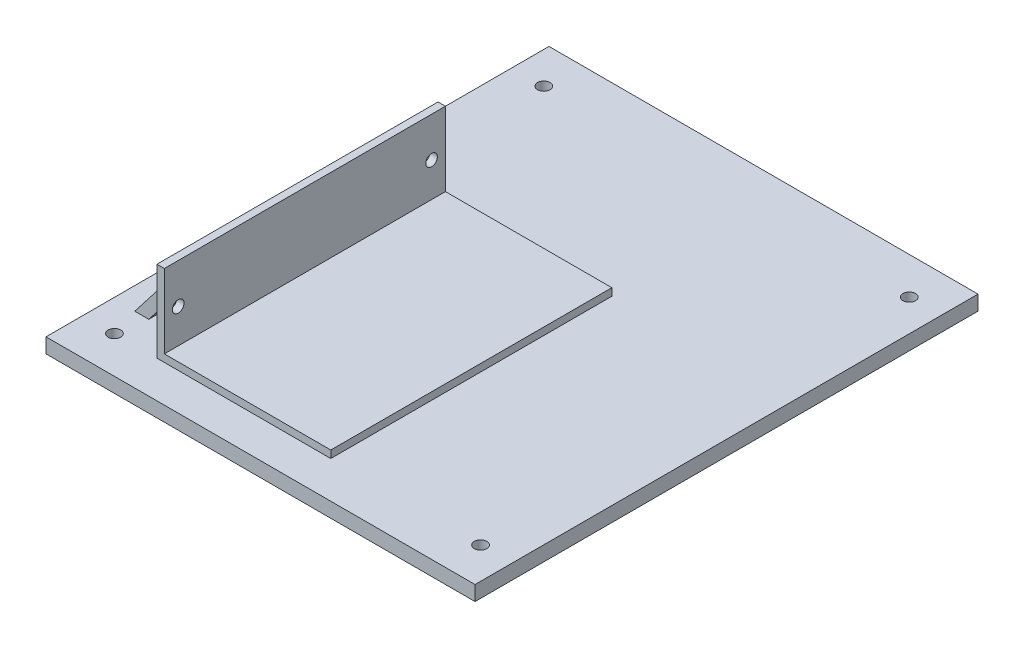
ISO-10303-21;
HEADER;
FILE_DESCRIPTION(('STEP AP214'),'2;1');
FILE_NAME('part.step','',(''),(''),'','','');
FILE_SCHEMA(('AUTOMOTIVE_DESIGN { 1 0 10303 214 1 1 1 1 }'));
ENDSEC;
DATA;
#1=APPLICATION_CONTEXT('core data for automotive mechanical design processes');
#2=APPLICATION_PROTOCOL_DEFINITION('international standard','automotive_design',2000,#1);
#3=PRODUCT_CONTEXT('',#1,'mechanical');
#4=PRODUCT('Part','Part','',(#3));
#5=PRODUCT_RELATED_PRODUCT_CATEGORY('part','',(#4));
#6=PRODUCT_DEFINITION_FORMATION('','',#4);
#7=PRODUCT_DEFINITION_CONTEXT('part definition',#1,'design');
#8=PRODUCT_DEFINITION('design','',#6,#7);
#9=PRODUCT_DEFINITION_SHAPE('','',#8);
#10=(LENGTH_UNIT() NAMED_UNIT(*) SI_UNIT(.MILLI.,.METRE.));
#11=(NAMED_UNIT(*) PLANE_ANGLE_UNIT() SI_UNIT($,.RADIAN.));
#12=(NAMED_UNIT(*) SI_UNIT($,.STERADIAN.) SOLID_ANGLE_UNIT());
#13=UNCERTAINTY_MEASURE_WITH_UNIT(LENGTH_MEASURE(1.E-05),#10,'distance_accuracy_value','');
#14=(GEOMETRIC_REPRESENTATION_CONTEXT(3) GLOBAL_UNCERTAINTY_ASSIGNED_CONTEXT((#13)) GLOBAL_UNIT_ASSIGNED_CONTEXT((#10,
#11,#12)) REPRESENTATION_CONTEXT('',''));
#15=CARTESIAN_POINT('',(0.,0.,0.));
#16=DIRECTION('',(0.,0.,1.));
#17=DIRECTION('',(1.,0.,0.));
#18=AXIS2_PLACEMENT_3D('',#15,#16,#17);
#19=CARTESIAN_POINT('',(-73.66,2.54,172.72));
#20=DIRECTION('',(0.,-1.,0.));
#21=DIRECTION('',(0.,0.,-1.));
#22=AXIS2_PLACEMENT_3D('',#19,#20,#21);
#23=PLANE('',#22);
#24=CARTESIAN_POINT('',(-62.738,2.54,12.7));
#25=DIRECTION('',(0.,1.,0.));
#26=DIRECTION('',(0.,0.,1.));
#27=AXIS2_PLACEMENT_3D('',#24,#25,#26);
#28=CIRCLE('',#27,2.159);
#29=CARTESIAN_POINT('',(-62.738,2.54,14.859));
#30=VERTEX_POINT('',#29);
#31=EDGE_CURVE('E232',#30,#30,#28,.T.);
#32=ORIENTED_EDGE('',*,*,#31,.F.);
#33=EDGE_LOOP('',(#32));
#34=FACE_BOUND('',#33,.T.);
#35=DIRECTION('',(-1.,0.,0.));
#36=VECTOR('',#35,1.);
#37=CARTESIAN_POINT('',(-73.66,2.54,0.));
#38=LINE('',#37,#36);
#39=CARTESIAN_POINT('',(73.66,2.54,0.));
#40=VERTEX_POINT('',#39);
#41=CARTESIAN_POINT('',(-73.66,2.54,0.));
#42=VERTEX_POINT('',#41);
#43=EDGE_CURVE('E256',#40,#42,#38,.T.);
#44=ORIENTED_EDGE('',*,*,#43,.T.);
#45=DIRECTION('',(0.,0.,-1.));
#46=VECTOR('',#45,1.);
#47=CARTESIAN_POINT('',(-73.66,2.54,172.72));
#48=LINE('',#47,#46);
#49=CARTESIAN_POINT('',(-73.66,2.54,172.72));
#50=VERTEX_POINT('',#49);
#51=EDGE_CURVE('E50',#50,#42,#48,.T.);
#52=ORIENTED_EDGE('',*,*,#51,.F.);
#53=DIRECTION('',(-1.,0.,0.));
#54=VECTOR('',#53,1.);
#55=CARTESIAN_POINT('',(-73.66,2.54,172.72));
#56=LINE('',#55,#54);
#57=CARTESIAN_POINT('',(73.66,2.54,172.72));
#58=VERTEX_POINT('',#57);
#59=EDGE_CURVE('E246',#58,#50,#56,.T.);
#60=ORIENTED_EDGE('',*,*,#59,.F.);
#61=DIRECTION('',(0.,0.,-1.));
#62=VECTOR('',#61,1.);
#63=CARTESIAN_POINT('',(73.66,2.54,172.72));
#64=LINE('',#63,#62);
#65=EDGE_CURVE('E11',#58,#40,#64,.T.);
#66=ORIENTED_EDGE('',*,*,#65,.T.);
#67=EDGE_LOOP('',(#44,#52,#60,#66));
#68=FACE_BOUND('',#67,.T.);
#69=DIRECTION('',(0.,0.,1.));
#70=VECTOR('',#69,1.);
#71=CARTESIAN_POINT('',(-48.26,2.54,63.5));
#72=LINE('',#71,#70);
#73=CARTESIAN_POINT('',(-48.26,2.54,63.5));
#74=VERTEX_POINT('',#73);
#75=CARTESIAN_POINT('',(-48.26,2.54,160.02));
#76=VERTEX_POINT('',#75);
#77=EDGE_CURVE('E190',#74,#76,#72,.T.);
#78=ORIENTED_EDGE('',*,*,#77,.F.);
#79=DIRECTION('',(-1.,0.,0.));
#80=VECTOR('',#79,1.);
#81=CARTESIAN_POINT('',(-48.26,2.54,63.5));
#82=LINE('',#81,#80);
#83=CARTESIAN_POINT('',(11.43,2.54,63.5));
#84=VERTEX_POINT('',#83);
#85=EDGE_CURVE('E194',#84,#74,#82,.T.);
#86=ORIENTED_EDGE('',*,*,#85,.F.);
#87=DIRECTION('',(0.,0.,-1.));
#88=VECTOR('',#87,1.);
#89=CARTESIAN_POINT('',(11.43,2.54,63.5));
#90=LINE('',#89,#88);
#91=CARTESIAN_POINT('',(11.43,2.54,160.02));
#92=VERTEX_POINT('',#91);
#93=EDGE_CURVE('E203',#92,#84,#90,.T.);
#94=ORIENTED_EDGE('',*,*,#93,.F.);
#95=DIRECTION('',(1.,0.,0.));
#96=VECTOR('',#95,1.);
#97=CARTESIAN_POINT('',(-48.26,2.54,160.02));
#98=LINE('',#97,#96);
#99=EDGE_CURVE('E200',#76,#92,#98,.T.);
#100=ORIENTED_EDGE('',*,*,#99,.F.);
#101=EDGE_LOOP('',(#78,#86,#94,#100));
#102=FACE_BOUND('',#101,.T.);
#103=CARTESIAN_POINT('',(62.865,2.54,160.02));
#104=DIRECTION('',(0.,1.,0.));
#105=DIRECTION('',(0.,0.,1.));
#106=AXIS2_PLACEMENT_3D('',#103,#104,#105);
#107=CIRCLE('',#106,2.15899999999999);
#108=CARTESIAN_POINT('',(62.865,2.54,162.179));
#109=VERTEX_POINT('',#108);
#110=EDGE_CURVE('E226',#109,#109,#107,.T.);
#111=ORIENTED_EDGE('',*,*,#110,.F.);
#112=EDGE_LOOP('',(#111));
#113=FACE_BOUND('',#112,.T.);
#114=CARTESIAN_POINT('',(-62.865,2.54,160.02));
#115=DIRECTION('',(0.,1.,0.));
#116=DIRECTION('',(0.,0.,1.));
#117=AXIS2_PLACEMENT_3D('',#114,#115,#116);
#118=CIRCLE('',#117,2.15899999999999);
#119=CARTESIAN_POINT('',(-62.865,2.54,162.179));
#120=VERTEX_POINT('',#119);
#121=EDGE_CURVE('E219',#120,#120,#118,.T.);
#122=ORIENTED_EDGE('',*,*,#121,.F.);
#123=EDGE_LOOP('',(#122));
#124=FACE_BOUND('',#123,.T.);
#125=CARTESIAN_POINT('',(62.738,2.54,12.7));
#126=DIRECTION('',(0.,1.,0.));
#127=DIRECTION('',(0.,0.,1.));
#128=AXIS2_PLACEMENT_3D('',#125,#126,#127);
#129=CIRCLE('',#128,2.15899999999999);
#130=CARTESIAN_POINT('',(62.738,2.54,14.859));
#131=VERTEX_POINT('',#130);
#132=EDGE_CURVE('E222',#131,#131,#129,.T.);
#133=ORIENTED_EDGE('',*,*,#132,.F.);
#134=EDGE_LOOP('',(#133));
#135=FACE_BOUND('',#134,.T.);
#136=DIRECTION('',(1.,0.,0.));
#137=VECTOR('',#136,1.);
#138=CARTESIAN_POINT('',(-66.04,2.54,73.66));
#139=LINE('',#138,#137);
#140=CARTESIAN_POINT('',(-66.04,2.54,73.66));
#141=VERTEX_POINT('',#140);
#142=CARTESIAN_POINT('',(-61.2132573670803,2.54,73.66));
#143=VERTEX_POINT('',#142);
#144=EDGE_CURVE('E149',#141,#143,#139,.T.);
#145=ORIENTED_EDGE('',*,*,#144,.T.);
#146=DIRECTION('',(0.,0.,1.));
#147=VECTOR('',#146,1.);
#148=CARTESIAN_POINT('',(-61.2132573670803,2.54,0.));
#149=LINE('',#148,#147);
#150=CARTESIAN_POINT('',(-61.2132573670803,2.54,149.86));
#151=VERTEX_POINT('',#150);
#152=EDGE_CURVE('E144',#143,#151,#149,.T.);
#153=ORIENTED_EDGE('',*,*,#152,.T.);
#154=DIRECTION('',(1.,0.,0.));
#155=VECTOR('',#154,1.);
#156=CARTESIAN_POINT('',(-66.04,2.54,149.86));
#157=LINE('',#156,#155);
#158=CARTESIAN_POINT('',(-66.04,2.54,149.86));
#159=VERTEX_POINT('',#158);
#160=EDGE_CURVE('E147',#159,#151,#157,.T.);
#161=ORIENTED_EDGE('',*,*,#160,.F.);
#162=DIRECTION('',(0.,0.,1.));
#163=VECTOR('',#162,1.);
#164=CARTESIAN_POINT('',(-66.04,2.54,73.66));
#165=LINE('',#164,#163);
#166=EDGE_CURVE('E163',#141,#159,#165,.T.);
#167=ORIENTED_EDGE('',*,*,#166,.F.);
#168=EDGE_LOOP('',(#145,#153,#161,#167));
#169=FACE_BOUND('',#168,.T.);
#170=ADVANCED_FACE('F42',(#34,#68,#102,#113,#124,#135,#169),#23,.F.);
#171=CARTESIAN_POINT('',(-48.26,5.08,63.5));
#172=DIRECTION('',(1.,0.,0.));
#173=DIRECTION('',(0.,0.,-1.));
#174=AXIS2_PLACEMENT_3D('',#171,#172,#173);
#175=PLANE('',#174);
#176=CARTESIAN_POINT('',(-48.26,16.83,155.26));
#177=DIRECTION('',(1.,0.,0.));
#178=DIRECTION('',(0.,0.,-1.));
#179=AXIS2_PLACEMENT_3D('',#176,#177,#178);
#180=CIRCLE('',#179,2.);
#181=CARTESIAN_POINT('',(-48.26,16.83,153.26));
#182=VERTEX_POINT('',#181);
#183=EDGE_CURVE('E152',#182,#182,#180,.T.);
#184=ORIENTED_EDGE('',*,*,#183,.T.);
#185=EDGE_LOOP('',(#184));
#186=FACE_BOUND('',#185,.T.);
#187=CARTESIAN_POINT('',(-48.26,16.83,68.26));
#188=DIRECTION('',(1.,0.,0.));
#189=DIRECTION('',(0.,0.,-1.));
#190=AXIS2_PLACEMENT_3D('',#187,#188,#189);
#191=CIRCLE('',#190,2.);
#192=CARTESIAN_POINT('',(-48.26,16.83,66.26));
#193=VERTEX_POINT('',#192);
#194=EDGE_CURVE('E420',#193,#193,#191,.T.);
#195=ORIENTED_EDGE('',*,*,#194,.T.);
#196=EDGE_LOOP('',(#195));
#197=FACE_BOUND('',#196,.T.);
#198=DIRECTION('',(0.,0.,1.));
#199=VECTOR('',#198,1.);
#200=CARTESIAN_POINT('',(-48.26,19.194188043389,0.));
#201=LINE('',#200,#199);
#202=CARTESIAN_POINT('',(-48.26,19.194188043389,73.66));
#203=VERTEX_POINT('',#202);
#204=CARTESIAN_POINT('',(-48.26,19.194188043389,149.86));
#205=VERTEX_POINT('',#204);
#206=EDGE_CURVE('E57',#203,#205,#201,.T.);
#207=ORIENTED_EDGE('',*,*,#206,.F.);
#208=DIRECTION('',(0.,-1.,0.));
#209=VECTOR('',#208,1.);
#210=CARTESIAN_POINT('',(-48.26,2.54,73.66));
#211=LINE('',#210,#209);
#212=CARTESIAN_POINT('',(-48.26,25.4,73.66));
#213=VERTEX_POINT('',#212);
#214=EDGE_CURVE('E430',#213,#203,#211,.T.);
#215=ORIENTED_EDGE('',*,*,#214,.F.);
#216=DIRECTION('',(0.,0.,-1.));
#217=VECTOR('',#216,1.);
#218=CARTESIAN_POINT('',(-48.26,25.4,73.66));
#219=LINE('',#218,#217);
#220=CARTESIAN_POINT('',(-48.26,25.4,149.86));
#221=VERTEX_POINT('',#220);
#222=EDGE_CURVE('E167',#221,#213,#219,.T.);
#223=ORIENTED_EDGE('',*,*,#222,.F.);
#224=DIRECTION('',(0.,1.,0.));
#225=VECTOR('',#224,1.);
#226=CARTESIAN_POINT('',(-48.26,2.54,149.86));
#227=LINE('',#226,#225);
#228=EDGE_CURVE('E433',#205,#221,#227,.T.);
#229=ORIENTED_EDGE('',*,*,#228,.F.);
#230=EDGE_LOOP('',(#207,#215,#223,#229));
#231=FACE_BOUND('',#230,.T.);
#232=DIRECTION('',(0.,-1.,0.));
#233=VECTOR('',#232,1.);
#234=CARTESIAN_POINT('',(-48.26,5.08,63.5));
#235=LINE('',#234,#233);
#236=CARTESIAN_POINT('',(-48.26,30.48,63.5));
#237=VERTEX_POINT('',#236);
#238=EDGE_CURVE('E198',#237,#74,#235,.T.);
#239=ORIENTED_EDGE('',*,*,#238,.T.);
#240=ORIENTED_EDGE('',*,*,#77,.T.);
#241=DIRECTION('',(0.,-1.,0.));
#242=VECTOR('',#241,1.);
#243=CARTESIAN_POINT('',(-48.26,5.08,160.02));
#244=LINE('',#243,#242);
#245=CARTESIAN_POINT('',(-48.26,30.48,160.02));
#246=VERTEX_POINT('',#245);
#247=EDGE_CURVE('E215',#246,#76,#244,.T.);
#248=ORIENTED_EDGE('',*,*,#247,.F.);
#249=DIRECTION('',(0.,0.,1.));
#250=VECTOR('',#249,1.);
#251=CARTESIAN_POINT('',(-48.26,30.48,63.5));
#252=LINE('',#251,#250);
#253=EDGE_CURVE('E172',#237,#246,#252,.T.);
#254=ORIENTED_EDGE('',*,*,#253,.F.);
#255=EDGE_LOOP('',(#239,#240,#248,#254));
#256=FACE_BOUND('',#255,.T.);
#257=ADVANCED_FACE('F288',(#186,#197,#231,#256),#175,.F.);
#258=CARTESIAN_POINT('',(73.66,-2.54,172.72));
#259=DIRECTION('',(-1.,0.,0.));
#260=DIRECTION('',(0.,0.,1.));
#261=AXIS2_PLACEMENT_3D('',#258,#259,#260);
#262=PLANE('',#261);
#263=DIRECTION('',(0.,1.,0.));
#264=VECTOR('',#263,1.);
#265=CARTESIAN_POINT('',(73.66,-2.54,0.));
#266=LINE('',#265,#264);
#267=CARTESIAN_POINT('',(73.66,-2.54,0.));
#268=VERTEX_POINT('',#267);
#269=EDGE_CURVE('E240',#268,#40,#266,.T.);
#270=ORIENTED_EDGE('',*,*,#269,.T.);
#271=ORIENTED_EDGE('',*,*,#65,.F.);
#272=DIRECTION('',(0.,1.,0.));
#273=VECTOR('',#272,1.);
#274=CARTESIAN_POINT('',(73.66,-2.54,172.72));
#275=LINE('',#274,#273);
#276=CARTESIAN_POINT('',(73.66,-2.54,172.72));
#277=VERTEX_POINT('',#276);
#278=EDGE_CURVE('E243',#277,#58,#275,.T.);
#279=ORIENTED_EDGE('',*,*,#278,.F.);
#280=DIRECTION('',(0.,0.,-1.));
#281=VECTOR('',#280,1.);
#282=CARTESIAN_POINT('',(73.66,-2.54,172.72));
#283=LINE('',#282,#281);
#284=EDGE_CURVE('E253',#277,#268,#283,.T.);
#285=ORIENTED_EDGE('',*,*,#284,.T.);
#286=EDGE_LOOP('',(#270,#271,#279,#285));
#287=FACE_BOUND('',#286,.T.);
#288=ADVANCED_FACE('F44',(#287),#262,.F.);
#289=CARTESIAN_POINT('',(-73.66,-2.54,172.72));
#290=DIRECTION('',(1.,0.,0.));
#291=DIRECTION('',(0.,0.,-1.));
#292=AXIS2_PLACEMENT_3D('',#289,#290,#291);
#293=PLANE('',#292);
#294=DIRECTION('',(0.,-1.,0.));
#295=VECTOR('',#294,1.);
#296=CARTESIAN_POINT('',(-73.66,-2.54,0.));
#297=LINE('',#296,#295);
#298=CARTESIAN_POINT('',(-73.66,-2.54,0.));
#299=VERTEX_POINT('',#298);
#300=EDGE_CURVE('E258',#42,#299,#297,.T.);
#301=ORIENTED_EDGE('',*,*,#300,.T.);
#302=DIRECTION('',(0.,0.,-1.));
#303=VECTOR('',#302,1.);
#304=CARTESIAN_POINT('',(-73.66,-2.54,172.72));
#305=LINE('',#304,#303);
#306=CARTESIAN_POINT('',(-73.66,-2.54,172.72));
#307=VERTEX_POINT('',#306);
#308=EDGE_CURVE('E263',#307,#299,#305,.T.);
#309=ORIENTED_EDGE('',*,*,#308,.F.);
#310=DIRECTION('',(0.,-1.,0.));
#311=VECTOR('',#310,1.);
#312=CARTESIAN_POINT('',(-73.66,-2.54,172.72));
#313=LINE('',#312,#311);
#314=EDGE_CURVE('E249',#50,#307,#313,.T.);
#315=ORIENTED_EDGE('',*,*,#314,.F.);
#316=ORIENTED_EDGE('',*,*,#51,.T.);
#317=EDGE_LOOP('',(#301,#309,#315,#316));
#318=FACE_BOUND('',#317,.T.);
#319=ADVANCED_FACE('F270',(#318),#293,.F.);
#320=CARTESIAN_POINT('',(-73.66,-2.54,172.72));
#321=DIRECTION('',(0.,1.,0.));
#322=DIRECTION('',(0.,0.,1.));
#323=AXIS2_PLACEMENT_3D('',#320,#321,#322);
#324=PLANE('',#323);
#325=CARTESIAN_POINT('',(-62.738,-2.54,12.7));
#326=DIRECTION('',(0.,1.,0.));
#327=DIRECTION('',(0.,0.,1.));
#328=AXIS2_PLACEMENT_3D('',#325,#326,#327);
#329=CIRCLE('',#328,2.159);
#330=CARTESIAN_POINT('',(-62.738,-2.54,14.859));
#331=VERTEX_POINT('',#330);
#332=EDGE_CURVE('E218',#331,#331,#329,.T.);
#333=ORIENTED_EDGE('',*,*,#332,.T.);
#334=EDGE_LOOP('',(#333));
#335=FACE_BOUND('',#334,.T.);
#336=CARTESIAN_POINT('',(62.865,-2.54,160.02));
#337=DIRECTION('',(0.,1.,0.));
#338=DIRECTION('',(0.,0.,1.));
#339=AXIS2_PLACEMENT_3D('',#336,#337,#338);
#340=CIRCLE('',#339,2.15899999999999);
#341=CARTESIAN_POINT('',(62.865,-2.54,162.179));
#342=VERTEX_POINT('',#341);
#343=EDGE_CURVE('E229',#342,#342,#340,.T.);
#344=ORIENTED_EDGE('',*,*,#343,.T.);
#345=EDGE_LOOP('',(#344));
#346=FACE_BOUND('',#345,.T.);
#347=CARTESIAN_POINT('',(-62.865,-2.54,160.02));
#348=DIRECTION('',(0.,1.,0.));
#349=DIRECTION('',(0.,0.,1.));
#350=AXIS2_PLACEMENT_3D('',#347,#348,#349);
#351=CIRCLE('',#350,2.15899999999999);
#352=CARTESIAN_POINT('',(-62.865,-2.54,162.179));
#353=VERTEX_POINT('',#352);
#354=EDGE_CURVE('E223',#353,#353,#351,.T.);
#355=ORIENTED_EDGE('',*,*,#354,.T.);
#356=EDGE_LOOP('',(#355));
#357=FACE_BOUND('',#356,.T.);
#358=CARTESIAN_POINT('',(62.738,-2.54,12.7));
#359=DIRECTION('',(0.,1.,0.));
#360=DIRECTION('',(0.,0.,1.));
#361=AXIS2_PLACEMENT_3D('',#358,#359,#360);
#362=CIRCLE('',#361,2.15899999999999);
#363=CARTESIAN_POINT('',(62.738,-2.54,14.859));
#364=VERTEX_POINT('',#363);
#365=EDGE_CURVE('E237',#364,#364,#362,.T.);
#366=ORIENTED_EDGE('',*,*,#365,.T.);
#367=EDGE_LOOP('',(#366));
#368=FACE_BOUND('',#367,.T.);
#369=DIRECTION('',(1.,0.,0.));
#370=VECTOR('',#369,1.);
#371=CARTESIAN_POINT('',(-73.66,-2.54,0.));
#372=LINE('',#371,#370);
#373=EDGE_CURVE('E247',#299,#268,#372,.T.);
#374=ORIENTED_EDGE('',*,*,#373,.T.);
#375=ORIENTED_EDGE('',*,*,#284,.F.);
#376=DIRECTION('',(1.,0.,0.));
#377=VECTOR('',#376,1.);
#378=CARTESIAN_POINT('',(-73.66,-2.54,172.72));
#379=LINE('',#378,#377);
#380=EDGE_CURVE('E251',#307,#277,#379,.T.);
#381=ORIENTED_EDGE('',*,*,#380,.F.);
#382=ORIENTED_EDGE('',*,*,#308,.T.);
#383=EDGE_LOOP('',(#374,#375,#381,#382));
#384=FACE_BOUND('',#383,.T.);
#385=ADVANCED_FACE('F279',(#335,#346,#357,#368,#384),#324,.F.);
#386=CARTESIAN_POINT('',(0.,0.,172.72));
#387=DIRECTION('',(0.,0.,-1.));
#388=DIRECTION('',(-1.,0.,0.));
#389=AXIS2_PLACEMENT_3D('',#386,#387,#388);
#390=PLANE('',#389);
#391=ORIENTED_EDGE('',*,*,#278,.T.);
#392=ORIENTED_EDGE('',*,*,#59,.T.);
#393=ORIENTED_EDGE('',*,*,#314,.T.);
#394=ORIENTED_EDGE('',*,*,#380,.T.);
#395=EDGE_LOOP('',(#391,#392,#393,#394));
#396=FACE_BOUND('',#395,.T.);
#397=ADVANCED_FACE('F285',(#396),#390,.F.);
#398=CARTESIAN_POINT('',(0.,0.,0.));
#399=DIRECTION('',(0.,0.,-1.));
#400=DIRECTION('',(-1.,0.,0.));
#401=AXIS2_PLACEMENT_3D('',#398,#399,#400);
#402=PLANE('',#401);
#403=ORIENTED_EDGE('',*,*,#269,.F.);
#404=ORIENTED_EDGE('',*,*,#373,.F.);
#405=ORIENTED_EDGE('',*,*,#300,.F.);
#406=ORIENTED_EDGE('',*,*,#43,.F.);
#407=EDGE_LOOP('',(#403,#404,#405,#406));
#408=FACE_BOUND('',#407,.T.);
#409=ADVANCED_FACE('F276',(#408),#402,.T.);
#410=CARTESIAN_POINT('',(62.738,-2.54,12.7));
#411=DIRECTION('',(0.,1.,0.));
#412=DIRECTION('',(0.,0.,1.));
#413=AXIS2_PLACEMENT_3D('',#410,#411,#412);
#414=CYLINDRICAL_SURFACE('',#413,2.15899999999999);
#415=ORIENTED_EDGE('',*,*,#365,.F.);
#416=EDGE_LOOP('',(#415));
#417=FACE_BOUND('',#416,.T.);
#418=ORIENTED_EDGE('',*,*,#132,.T.);
#419=EDGE_LOOP('',(#418));
#420=FACE_BOUND('',#419,.T.);
#421=ADVANCED_FACE('F299',(#417,#420),#414,.F.);
#422=CARTESIAN_POINT('',(-62.865,-2.54,160.02));
#423=DIRECTION('',(0.,1.,0.));
#424=DIRECTION('',(0.,0.,1.));
#425=AXIS2_PLACEMENT_3D('',#422,#423,#424);
#426=CYLINDRICAL_SURFACE('',#425,2.15899999999999);
#427=ORIENTED_EDGE('',*,*,#354,.F.);
#428=EDGE_LOOP('',(#427));
#429=FACE_BOUND('',#428,.T.);
#430=ORIENTED_EDGE('',*,*,#121,.T.);
#431=EDGE_LOOP('',(#430));
#432=FACE_BOUND('',#431,.T.);
#433=ADVANCED_FACE('F301',(#429,#432),#426,.F.);
#434=CARTESIAN_POINT('',(62.865,-2.54,160.02));
#435=DIRECTION('',(0.,1.,0.));
#436=DIRECTION('',(0.,0.,1.));
#437=AXIS2_PLACEMENT_3D('',#434,#435,#436);
#438=CYLINDRICAL_SURFACE('',#437,2.15899999999999);
#439=ORIENTED_EDGE('',*,*,#343,.F.);
#440=EDGE_LOOP('',(#439));
#441=FACE_BOUND('',#440,.T.);
#442=ORIENTED_EDGE('',*,*,#110,.T.);
#443=EDGE_LOOP('',(#442));
#444=FACE_BOUND('',#443,.T.);
#445=ADVANCED_FACE('F308',(#441,#444),#438,.F.);
#446=CARTESIAN_POINT('',(-62.738,-2.54,12.7));
#447=DIRECTION('',(0.,1.,0.));
#448=DIRECTION('',(0.,0.,1.));
#449=AXIS2_PLACEMENT_3D('',#446,#447,#448);
#450=CYLINDRICAL_SURFACE('',#449,2.159);
#451=ORIENTED_EDGE('',*,*,#332,.F.);
#452=EDGE_LOOP('',(#451));
#453=FACE_BOUND('',#452,.T.);
#454=ORIENTED_EDGE('',*,*,#31,.T.);
#455=EDGE_LOOP('',(#454));
#456=FACE_BOUND('',#455,.T.);
#457=ADVANCED_FACE('F315',(#453,#456),#450,.F.);
#458=CARTESIAN_POINT('',(-48.26,5.08,160.02));
#459=DIRECTION('',(0.,0.,-1.));
#460=DIRECTION('',(-1.,0.,0.));
#461=AXIS2_PLACEMENT_3D('',#458,#459,#460);
#462=PLANE('',#461);
#463=ORIENTED_EDGE('',*,*,#99,.T.);
#464=DIRECTION('',(0.,-1.,0.));
#465=VECTOR('',#464,1.);
#466=CARTESIAN_POINT('',(11.43,5.08,160.02));
#467=LINE('',#466,#465);
#468=CARTESIAN_POINT('',(11.43,5.08,160.02));
#469=VERTEX_POINT('',#468);
#470=EDGE_CURVE('E212',#469,#92,#467,.T.);
#471=ORIENTED_EDGE('',*,*,#470,.F.);
#472=DIRECTION('',(1.,0.,0.));
#473=VECTOR('',#472,1.);
#474=CARTESIAN_POINT('',(-48.26,5.08,160.02));
#475=LINE('',#474,#473);
#476=CARTESIAN_POINT('',(-45.72,5.08,160.02));
#477=VERTEX_POINT('',#476);
#478=EDGE_CURVE('E191',#477,#469,#475,.T.);
#479=ORIENTED_EDGE('',*,*,#478,.F.);
#480=DIRECTION('',(0.,-1.,0.));
#481=VECTOR('',#480,1.);
#482=CARTESIAN_POINT('',(-45.72,30.48,160.02));
#483=LINE('',#482,#481);
#484=CARTESIAN_POINT('',(-45.72,30.48,160.02));
#485=VERTEX_POINT('',#484);
#486=EDGE_CURVE('E187',#485,#477,#483,.T.);
#487=ORIENTED_EDGE('',*,*,#486,.F.);
#488=DIRECTION('',(1.,0.,0.));
#489=VECTOR('',#488,1.);
#490=CARTESIAN_POINT('',(-48.26,30.48,160.02));
#491=LINE('',#490,#489);
#492=EDGE_CURVE('E175',#246,#485,#491,.T.);
#493=ORIENTED_EDGE('',*,*,#492,.F.);
#494=ORIENTED_EDGE('',*,*,#247,.T.);
#495=EDGE_LOOP('',(#463,#471,#479,#487,#493,#494));
#496=FACE_BOUND('',#495,.T.);
#497=ADVANCED_FACE('F336',(#496),#462,.F.);
#498=CARTESIAN_POINT('',(11.43,5.08,63.5));
#499=DIRECTION('',(-1.,0.,0.));
#500=DIRECTION('',(0.,0.,1.));
#501=AXIS2_PLACEMENT_3D('',#498,#499,#500);
#502=PLANE('',#501);
#503=ORIENTED_EDGE('',*,*,#93,.T.);
#504=DIRECTION('',(0.,-1.,0.));
#505=VECTOR('',#504,1.);
#506=CARTESIAN_POINT('',(11.43,5.08,63.5));
#507=LINE('',#506,#505);
#508=CARTESIAN_POINT('',(11.43,5.08,63.5));
#509=VERTEX_POINT('',#508);
#510=EDGE_CURVE('E209',#509,#84,#507,.T.);
#511=ORIENTED_EDGE('',*,*,#510,.F.);
#512=DIRECTION('',(0.,0.,-1.));
#513=VECTOR('',#512,1.);
#514=CARTESIAN_POINT('',(11.43,5.08,63.5));
#515=LINE('',#514,#513);
#516=EDGE_CURVE('E193',#469,#509,#515,.T.);
#517=ORIENTED_EDGE('',*,*,#516,.F.);
#518=ORIENTED_EDGE('',*,*,#470,.T.);
#519=EDGE_LOOP('',(#503,#511,#517,#518));
#520=FACE_BOUND('',#519,.T.);
#521=ADVANCED_FACE('F354',(#520),#502,.F.);
#522=CARTESIAN_POINT('',(-48.26,5.08,63.5));
#523=DIRECTION('',(0.,0.,1.));
#524=DIRECTION('',(1.,0.,0.));
#525=AXIS2_PLACEMENT_3D('',#522,#523,#524);
#526=PLANE('',#525);
#527=ORIENTED_EDGE('',*,*,#85,.T.);
#528=ORIENTED_EDGE('',*,*,#238,.F.);
#529=DIRECTION('',(-1.,0.,0.));
#530=VECTOR('',#529,1.);
#531=CARTESIAN_POINT('',(-48.26,30.48,63.5));
#532=LINE('',#531,#530);
#533=CARTESIAN_POINT('',(-45.72,30.48,63.5));
#534=VERTEX_POINT('',#533);
#535=EDGE_CURVE('E179',#534,#237,#532,.T.);
#536=ORIENTED_EDGE('',*,*,#535,.F.);
#537=DIRECTION('',(0.,-1.,0.));
#538=VECTOR('',#537,1.);
#539=CARTESIAN_POINT('',(-45.72,30.48,63.5));
#540=LINE('',#539,#538);
#541=CARTESIAN_POINT('',(-45.72,5.08,63.5));
#542=VERTEX_POINT('',#541);
#543=EDGE_CURVE('E182',#534,#542,#540,.T.);
#544=ORIENTED_EDGE('',*,*,#543,.T.);
#545=DIRECTION('',(-1.,0.,0.));
#546=VECTOR('',#545,1.);
#547=CARTESIAN_POINT('',(-48.26,5.08,63.5));
#548=LINE('',#547,#546);
#549=EDGE_CURVE('E196',#509,#542,#548,.T.);
#550=ORIENTED_EDGE('',*,*,#549,.F.);
#551=ORIENTED_EDGE('',*,*,#510,.T.);
#552=EDGE_LOOP('',(#527,#528,#536,#544,#550,#551));
#553=FACE_BOUND('',#552,.T.);
#554=ADVANCED_FACE('F362',(#553),#526,.F.);
#555=CARTESIAN_POINT('',(0.,5.08,0.));
#556=DIRECTION('',(0.,1.,0.));
#557=DIRECTION('',(0.,0.,1.));
#558=AXIS2_PLACEMENT_3D('',#555,#556,#557);
#559=PLANE('',#558);
#560=DIRECTION('',(0.,0.,-1.));
#561=VECTOR('',#560,1.);
#562=CARTESIAN_POINT('',(-45.72,5.08,63.5));
#563=LINE('',#562,#561);
#564=EDGE_CURVE('E165',#477,#542,#563,.T.);
#565=ORIENTED_EDGE('',*,*,#564,.F.);
#566=ORIENTED_EDGE('',*,*,#478,.T.);
#567=ORIENTED_EDGE('',*,*,#516,.T.);
#568=ORIENTED_EDGE('',*,*,#549,.T.);
#569=EDGE_LOOP('',(#565,#566,#567,#568));
#570=FACE_BOUND('',#569,.T.);
#571=ADVANCED_FACE('F371',(#570),#559,.T.);
#572=CARTESIAN_POINT('',(-45.72,30.48,63.5));
#573=DIRECTION('',(-1.,0.,0.));
#574=DIRECTION('',(0.,0.,1.));
#575=AXIS2_PLACEMENT_3D('',#572,#573,#574);
#576=PLANE('',#575);
#577=CARTESIAN_POINT('',(-45.72,16.83,155.26));
#578=DIRECTION('',(1.,0.,0.));
#579=DIRECTION('',(0.,0.,-1.));
#580=AXIS2_PLACEMENT_3D('',#577,#578,#579);
#581=CIRCLE('',#580,2.);
#582=CARTESIAN_POINT('',(-45.72,16.83,153.26));
#583=VERTEX_POINT('',#582);
#584=EDGE_CURVE('E418',#583,#583,#581,.T.);
#585=ORIENTED_EDGE('',*,*,#584,.F.);
#586=EDGE_LOOP('',(#585));
#587=FACE_BOUND('',#586,.T.);
#588=CARTESIAN_POINT('',(-45.72,16.83,68.26));
#589=DIRECTION('',(1.,0.,0.));
#590=DIRECTION('',(0.,0.,-1.));
#591=AXIS2_PLACEMENT_3D('',#588,#589,#590);
#592=CIRCLE('',#591,2.);
#593=CARTESIAN_POINT('',(-45.72,16.83,66.26));
#594=VERTEX_POINT('',#593);
#595=EDGE_CURVE('E435',#594,#594,#592,.T.);
#596=ORIENTED_EDGE('',*,*,#595,.F.);
#597=EDGE_LOOP('',(#596));
#598=FACE_BOUND('',#597,.T.);
#599=ORIENTED_EDGE('',*,*,#564,.T.);
#600=ORIENTED_EDGE('',*,*,#543,.F.);
#601=DIRECTION('',(0.,0.,-1.));
#602=VECTOR('',#601,1.);
#603=CARTESIAN_POINT('',(-45.72,30.48,63.5));
#604=LINE('',#603,#602);
#605=EDGE_CURVE('E177',#485,#534,#604,.T.);
#606=ORIENTED_EDGE('',*,*,#605,.F.);
#607=ORIENTED_EDGE('',*,*,#486,.T.);
#608=EDGE_LOOP('',(#599,#600,#606,#607));
#609=FACE_BOUND('',#608,.T.);
#610=ADVANCED_FACE('F375',(#587,#598,#609),#576,.F.);
#611=CARTESIAN_POINT('',(0.,30.48,0.));
#612=DIRECTION('',(0.,1.,0.));
#613=DIRECTION('',(0.,0.,1.));
#614=AXIS2_PLACEMENT_3D('',#611,#612,#613);
#615=PLANE('',#614);
#616=ORIENTED_EDGE('',*,*,#253,.T.);
#617=ORIENTED_EDGE('',*,*,#492,.T.);
#618=ORIENTED_EDGE('',*,*,#605,.T.);
#619=ORIENTED_EDGE('',*,*,#535,.T.);
#620=EDGE_LOOP('',(#616,#617,#618,#619));
#621=FACE_BOUND('',#620,.T.);
#622=ADVANCED_FACE('F379',(#621),#615,.T.);
#623=CARTESIAN_POINT('',(-66.04,2.54,73.66));
#624=DIRECTION('',(0.,0.,1.));
#625=DIRECTION('',(1.,0.,0.));
#626=AXIS2_PLACEMENT_3D('',#623,#624,#625);
#627=PLANE('',#626);
#628=ORIENTED_EDGE('',*,*,#214,.T.);
#629=DIRECTION('',(-0.613940613514921,-0.789352217376326,0.));
#630=VECTOR('',#629,1.);
#631=CARTESIAN_POINT('',(-63.0325680517962,0.200886262508156,73.66));
#632=LINE('',#631,#630);
#633=EDGE_CURVE('E429',#203,#143,#632,.T.);
#634=ORIENTED_EDGE('',*,*,#633,.T.);
#635=ORIENTED_EDGE('',*,*,#144,.F.);
#636=DIRECTION('',(0.61394061351492,0.789352217376326,0.));
#637=VECTOR('',#636,1.);
#638=CARTESIAN_POINT('',(-66.04,2.54,73.66));
#639=LINE('',#638,#637);
#640=EDGE_CURVE('E65',#141,#213,#639,.T.);
#641=ORIENTED_EDGE('',*,*,#640,.T.);
#642=EDGE_LOOP('',(#628,#634,#635,#641));
#643=FACE_BOUND('',#642,.T.);
#644=ADVANCED_FACE('F395',(#643),#627,.F.);
#645=CARTESIAN_POINT('',(-66.04,2.54,149.86));
#646=DIRECTION('',(0.,0.,-1.));
#647=DIRECTION('',(-1.,0.,0.));
#648=AXIS2_PLACEMENT_3D('',#645,#646,#647);
#649=PLANE('',#648);
#650=ORIENTED_EDGE('',*,*,#160,.T.);
#651=DIRECTION('',(-0.613940613514921,-0.789352217376326,0.));
#652=VECTOR('',#651,1.);
#653=CARTESIAN_POINT('',(-61.2132573670803,2.54,149.86));
#654=LINE('',#653,#652);
#655=EDGE_CURVE('E155',#205,#151,#654,.T.);
#656=ORIENTED_EDGE('',*,*,#655,.F.);
#657=ORIENTED_EDGE('',*,*,#228,.T.);
#658=DIRECTION('',(0.61394061351492,0.789352217376326,0.));
#659=VECTOR('',#658,1.);
#660=CARTESIAN_POINT('',(-66.04,2.54,149.86));
#661=LINE('',#660,#659);
#662=EDGE_CURVE('E159',#159,#221,#661,.T.);
#663=ORIENTED_EDGE('',*,*,#662,.F.);
#664=EDGE_LOOP('',(#650,#656,#657,#663));
#665=FACE_BOUND('',#664,.T.);
#666=ADVANCED_FACE('F162',(#665),#649,.F.);
#667=CARTESIAN_POINT('',(-66.04,2.54,0.));
#668=DIRECTION('',(0.789352217376326,-0.61394061351492,0.));
#669=DIRECTION('',(0.61394061351492,0.789352217376326,0.));
#670=AXIS2_PLACEMENT_3D('',#667,#668,#669);
#671=PLANE('',#670);
#672=ORIENTED_EDGE('',*,*,#166,.T.);
#673=ORIENTED_EDGE('',*,*,#662,.T.);
#674=ORIENTED_EDGE('',*,*,#222,.T.);
#675=ORIENTED_EDGE('',*,*,#640,.F.);
#676=EDGE_LOOP('',(#672,#673,#674,#675));
#677=FACE_BOUND('',#676,.T.);
#678=ADVANCED_FACE('F401',(#677),#671,.F.);
#679=CARTESIAN_POINT('',(-61.2132573670803,2.54,0.));
#680=DIRECTION('',(-0.789352217376326,0.613940613514921,0.));
#681=DIRECTION('',(-0.613940613514921,-0.789352217376326,0.));
#682=AXIS2_PLACEMENT_3D('',#679,#680,#681);
#683=PLANE('',#682);
#684=ORIENTED_EDGE('',*,*,#206,.T.);
#685=ORIENTED_EDGE('',*,*,#655,.T.);
#686=ORIENTED_EDGE('',*,*,#152,.F.);
#687=ORIENTED_EDGE('',*,*,#633,.F.);
#688=EDGE_LOOP('',(#684,#685,#686,#687));
#689=FACE_BOUND('',#688,.T.);
#690=ADVANCED_FACE('F156',(#689),#683,.F.);
#691=CARTESIAN_POINT('',(-73.66,16.83,68.26));
#692=DIRECTION('',(1.,0.,0.));
#693=DIRECTION('',(0.,0.,-1.));
#694=AXIS2_PLACEMENT_3D('',#691,#692,#693);
#695=CYLINDRICAL_SURFACE('',#694,2.);
#696=ORIENTED_EDGE('',*,*,#595,.T.);
#697=EDGE_LOOP('',(#696));
#698=FACE_BOUND('',#697,.T.);
#699=ORIENTED_EDGE('',*,*,#194,.F.);
#700=EDGE_LOOP('',(#699));
#701=FACE_BOUND('',#700,.T.);
#702=ADVANCED_FACE('F406',(#698,#701),#695,.F.);
#703=CARTESIAN_POINT('',(-73.66,16.83,155.26));
#704=DIRECTION('',(1.,0.,0.));
#705=DIRECTION('',(0.,0.,-1.));
#706=AXIS2_PLACEMENT_3D('',#703,#704,#705);
#707=CYLINDRICAL_SURFACE('',#706,2.);
#708=ORIENTED_EDGE('',*,*,#584,.T.);
#709=EDGE_LOOP('',(#708));
#710=FACE_BOUND('',#709,.T.);
#711=ORIENTED_EDGE('',*,*,#183,.F.);
#712=EDGE_LOOP('',(#711));
#713=FACE_BOUND('',#712,.T.);
#714=ADVANCED_FACE('F409',(#710,#713),#707,.F.);
#715=CLOSED_SHELL('',(#170,#257,#288,#319,#385,#397,#409,#421,#433,#445,#457,#497,#521,#554,
#571,#610,#622,#644,#666,#678,#690,#702,#714));
#716=MANIFOLD_SOLID_BREP('B2',#715);
#717=ADVANCED_BREP_SHAPE_REPRESENTATION('',(#18,#716),#14);
#718=SHAPE_DEFINITION_REPRESENTATION(#9,#717);
ENDSEC;
END-ISO-10303-21;
